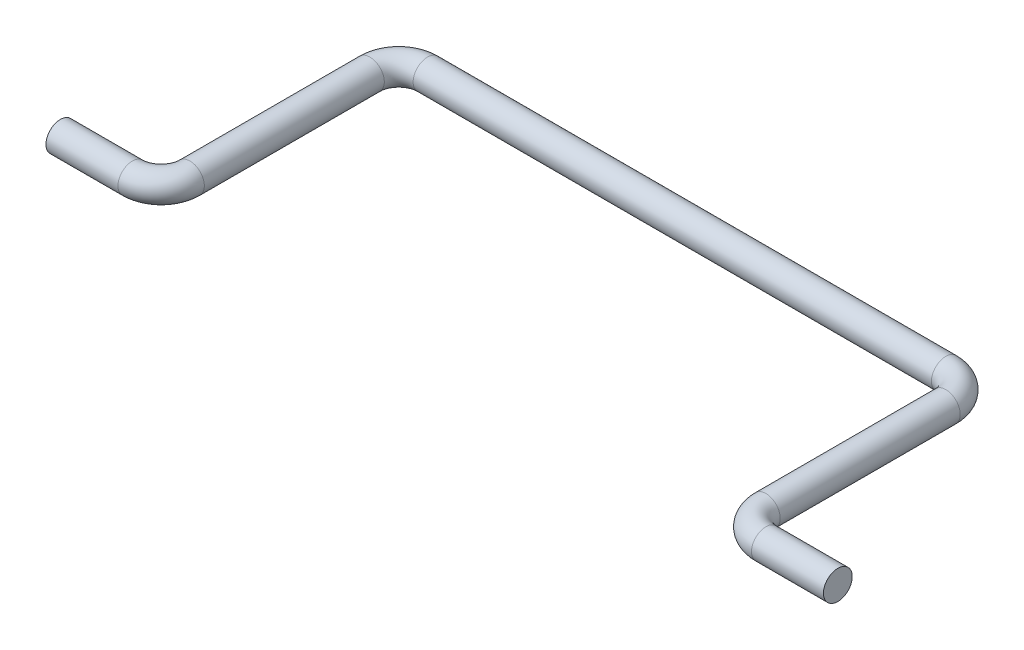
ISO-10303-21;
HEADER;
FILE_DESCRIPTION(('STEP AP214'),'2;1');
FILE_NAME('part.step','',(''),(''),'','','');
FILE_SCHEMA(('AUTOMOTIVE_DESIGN { 1 0 10303 214 1 1 1 1 }'));
ENDSEC;
DATA;
#1=APPLICATION_CONTEXT('core data for automotive mechanical design processes');
#2=APPLICATION_PROTOCOL_DEFINITION('international standard','automotive_design',2000,#1);
#3=PRODUCT_CONTEXT('',#1,'mechanical');
#4=PRODUCT('Part','Part','',(#3));
#5=PRODUCT_RELATED_PRODUCT_CATEGORY('part','',(#4));
#6=PRODUCT_DEFINITION_FORMATION('','',#4);
#7=PRODUCT_DEFINITION_CONTEXT('part definition',#1,'design');
#8=PRODUCT_DEFINITION('design','',#6,#7);
#9=PRODUCT_DEFINITION_SHAPE('','',#8);
#10=(LENGTH_UNIT() NAMED_UNIT(*) SI_UNIT(.MILLI.,.METRE.));
#11=(NAMED_UNIT(*) PLANE_ANGLE_UNIT() SI_UNIT($,.RADIAN.));
#12=(NAMED_UNIT(*) SI_UNIT($,.STERADIAN.) SOLID_ANGLE_UNIT());
#13=UNCERTAINTY_MEASURE_WITH_UNIT(LENGTH_MEASURE(1.E-05),#10,'distance_accuracy_value','');
#14=(GEOMETRIC_REPRESENTATION_CONTEXT(3) GLOBAL_UNCERTAINTY_ASSIGNED_CONTEXT((#13)) GLOBAL_UNIT_ASSIGNED_CONTEXT((#10,
#11,#12)) REPRESENTATION_CONTEXT('',''));
#15=CARTESIAN_POINT('',(0.,0.,0.));
#16=DIRECTION('',(0.,0.,1.));
#17=DIRECTION('',(1.,0.,0.));
#18=AXIS2_PLACEMENT_3D('',#15,#16,#17);
#19=CARTESIAN_POINT('',(-13.4999999999964,0.,0.));
#20=DIRECTION('',(1.,0.,0.));
#21=DIRECTION('',(0.,0.,-1.));
#22=AXIS2_PLACEMENT_3D('',#19,#20,#21);
#23=PLANE('',#22);
#24=CARTESIAN_POINT('',(-13.4999999999964,0.,0.));
#25=DIRECTION('',(1.,0.,0.));
#26=DIRECTION('',(0.,0.,-1.));
#27=AXIS2_PLACEMENT_3D('',#24,#25,#26);
#28=CIRCLE('',#27,0.5);
#29=CARTESIAN_POINT('',(-13.4999999999964,0.,-0.5));
#30=VERTEX_POINT('',#29);
#31=EDGE_CURVE('E44',#30,#30,#28,.T.);
#32=ORIENTED_EDGE('',*,*,#31,.F.);
#33=EDGE_LOOP('',(#32));
#34=FACE_BOUND('',#33,.T.);
#35=ADVANCED_FACE('F32',(#34),#23,.F.);
#36=CARTESIAN_POINT('',(13.4999999999964,0.,0.));
#37=DIRECTION('',(1.,0.,0.));
#38=DIRECTION('',(0.,0.,-1.));
#39=AXIS2_PLACEMENT_3D('',#36,#37,#38);
#40=PLANE('',#39);
#41=CARTESIAN_POINT('',(13.4999999999964,0.,0.));
#42=DIRECTION('',(1.,0.,0.));
#43=DIRECTION('',(0.,0.,-1.));
#44=AXIS2_PLACEMENT_3D('',#41,#42,#43);
#45=CIRCLE('',#44,0.5);
#46=CARTESIAN_POINT('',(13.4999999999964,0.,-0.5));
#47=VERTEX_POINT('',#46);
#48=EDGE_CURVE('E11',#47,#47,#45,.T.);
#49=ORIENTED_EDGE('',*,*,#48,.T.);
#50=EDGE_LOOP('',(#49));
#51=FACE_BOUND('',#50,.T.);
#52=ADVANCED_FACE('F47',(#51),#40,.T.);
#53=CARTESIAN_POINT('',(-13.4999999999964,0.,0.));
#54=DIRECTION('',(1.,0.,0.));
#55=DIRECTION('',(0.,0.,-1.));
#56=AXIS2_PLACEMENT_3D('',#53,#54,#55);
#57=CYLINDRICAL_SURFACE('',#56,0.5);
#58=CARTESIAN_POINT('',(-10.9999999999952,0.,0.));
#59=DIRECTION('',(1.,0.,0.));
#60=DIRECTION('',(0.,0.,-1.));
#61=AXIS2_PLACEMENT_3D('',#58,#59,#60);
#62=CIRCLE('',#61,0.5);
#63=CARTESIAN_POINT('',(-10.9999999999952,0.,0.500000000000094));
#64=VERTEX_POINT('',#63);
#65=EDGE_CURVE('E76',#64,#64,#62,.T.);
#66=ORIENTED_EDGE('',*,*,#65,.F.);
#67=EDGE_LOOP('',(#66));
#68=FACE_BOUND('',#67,.T.);
#69=ORIENTED_EDGE('',*,*,#31,.T.);
#70=EDGE_LOOP('',(#69));
#71=FACE_BOUND('',#70,.T.);
#72=ADVANCED_FACE('F80',(#68,#71),#57,.T.);
#73=CARTESIAN_POINT('',(-10.9999999999952,0.,-1.));
#74=DIRECTION('',(0.,1.,0.));
#75=DIRECTION('',(0.,0.,1.));
#76=AXIS2_PLACEMENT_3D('',#73,#74,#75);
#77=TOROIDAL_SURFACE('',#76,1.00000000000009,0.5);
#78=CARTESIAN_POINT('',(-9.99999999999519,0.,-1.00000000000001));
#79=DIRECTION('',(0.,0.,-1.));
#80=DIRECTION('',(-1.,0.,0.));
#81=AXIS2_PLACEMENT_3D('',#78,#79,#80);
#82=CIRCLE('',#81,0.5);
#83=CARTESIAN_POINT('',(-9.4999999999951,0.,-1.00000000000001));
#84=VERTEX_POINT('',#83);
#85=EDGE_CURVE('E73',#84,#84,#82,.T.);
#86=CARTESIAN_POINT('',(-10.9999999999952,0.,-1.));
#87=DIRECTION('',(0.,1.,0.));
#88=DIRECTION('',(0.,0.,1.));
#89=AXIS2_PLACEMENT_3D('',#86,#87,#88);
#90=CIRCLE('',#89,1.50000000000009);
#91=EDGE_CURVE('',#64,#84,#90,.T.);
#92=ORIENTED_EDGE('',*,*,#65,.T.);
#93=ORIENTED_EDGE('',*,*,#85,.F.);
#94=ORIENTED_EDGE('',*,*,#91,.T.);
#95=ORIENTED_EDGE('',*,*,#91,.F.);
#96=EDGE_LOOP('',(#92,#94,#93,#95));
#97=FACE_BOUND('',#96,.T.);
#98=ADVANCED_FACE('F82',(#97),#77,.T.);
#99=CARTESIAN_POINT('',(-9.99999999999519,0.,-1.00000000000001));
#100=DIRECTION('',(0.,0.,-1.));
#101=DIRECTION('',(-1.,0.,0.));
#102=AXIS2_PLACEMENT_3D('',#99,#100,#101);
#103=CYLINDRICAL_SURFACE('',#102,0.5);
#104=CARTESIAN_POINT('',(-9.99999999999519,0.,-7.25000000000193));
#105=DIRECTION('',(0.,0.,-1.));
#106=DIRECTION('',(-1.,0.,0.));
#107=AXIS2_PLACEMENT_3D('',#104,#105,#106);
#108=CIRCLE('',#107,0.5);
#109=CARTESIAN_POINT('',(-10.4999999999952,0.,-7.25000000000192));
#110=VERTEX_POINT('',#109);
#111=EDGE_CURVE('E70',#110,#110,#108,.T.);
#112=ORIENTED_EDGE('',*,*,#111,.F.);
#113=EDGE_LOOP('',(#112));
#114=FACE_BOUND('',#113,.T.);
#115=ORIENTED_EDGE('',*,*,#85,.T.);
#116=EDGE_LOOP('',(#115));
#117=FACE_BOUND('',#116,.T.);
#118=ADVANCED_FACE('F89',(#114,#117),#103,.T.);
#119=CARTESIAN_POINT('',(-8.99999999999519,0.,-7.25000000000193));
#120=DIRECTION('',(0.,-1.,0.));
#121=DIRECTION('',(0.,0.,-1.));
#122=AXIS2_PLACEMENT_3D('',#119,#120,#121);
#123=TOROIDAL_SURFACE('',#122,1.,0.5);
#124=CARTESIAN_POINT('',(-8.99999999999519,0.,-8.25000000000193));
#125=DIRECTION('',(1.,0.,0.));
#126=DIRECTION('',(0.,0.,-1.));
#127=AXIS2_PLACEMENT_3D('',#124,#125,#126);
#128=CIRCLE('',#127,0.5);
#129=CARTESIAN_POINT('',(-8.99999999999519,0.,-8.75000000000193));
#130=VERTEX_POINT('',#129);
#131=EDGE_CURVE('E67',#130,#130,#128,.T.);
#132=CARTESIAN_POINT('',(-8.99999999999519,0.,-7.25000000000193));
#133=DIRECTION('',(0.,-1.,0.));
#134=DIRECTION('',(0.,0.,-1.));
#135=AXIS2_PLACEMENT_3D('',#132,#133,#134);
#136=CIRCLE('',#135,1.5);
#137=EDGE_CURVE('',#110,#130,#136,.T.);
#138=ORIENTED_EDGE('',*,*,#111,.T.);
#139=ORIENTED_EDGE('',*,*,#131,.F.);
#140=ORIENTED_EDGE('',*,*,#137,.T.);
#141=ORIENTED_EDGE('',*,*,#137,.F.);
#142=EDGE_LOOP('',(#138,#140,#139,#141));
#143=FACE_BOUND('',#142,.T.);
#144=ADVANCED_FACE('F96',(#143),#123,.T.);
#145=CARTESIAN_POINT('',(-8.99999999999519,0.,-8.25000000000193));
#146=DIRECTION('',(1.,0.,0.));
#147=DIRECTION('',(0.,0.,-1.));
#148=AXIS2_PLACEMENT_3D('',#145,#146,#147);
#149=CYLINDRICAL_SURFACE('',#148,0.5);
#150=CARTESIAN_POINT('',(9.00000000000937,0.,-8.25000000000193));
#151=DIRECTION('',(1.,0.,0.));
#152=DIRECTION('',(0.,0.,-1.));
#153=AXIS2_PLACEMENT_3D('',#150,#151,#152);
#154=CIRCLE('',#153,0.5);
#155=CARTESIAN_POINT('',(9.00000000000936,0.,-8.75000000000203));
#156=VERTEX_POINT('',#155);
#157=EDGE_CURVE('E64',#156,#156,#154,.T.);
#158=ORIENTED_EDGE('',*,*,#157,.F.);
#159=EDGE_LOOP('',(#158));
#160=FACE_BOUND('',#159,.T.);
#161=ORIENTED_EDGE('',*,*,#131,.T.);
#162=EDGE_LOOP('',(#161));
#163=FACE_BOUND('',#162,.T.);
#164=ADVANCED_FACE('F100',(#160,#163),#149,.T.);
#165=CARTESIAN_POINT('',(9.00000000000938,0.,-7.25000000000193));
#166=DIRECTION('',(0.,-1.,0.));
#167=DIRECTION('',(0.,0.,-1.));
#168=AXIS2_PLACEMENT_3D('',#165,#166,#167);
#169=TOROIDAL_SURFACE('',#168,1.00000000000009,0.5);
#170=CARTESIAN_POINT('',(10.0000000000094,0.,-7.25000000000193));
#171=DIRECTION('',(0.,0.,1.));
#172=DIRECTION('',(1.,0.,0.));
#173=AXIS2_PLACEMENT_3D('',#170,#171,#172);
#174=CIRCLE('',#173,0.5);
#175=CARTESIAN_POINT('',(10.5000000000095,0.,-7.25000000000193));
#176=VERTEX_POINT('',#175);
#177=EDGE_CURVE('E59',#176,#176,#174,.T.);
#178=CARTESIAN_POINT('',(9.00000000000938,0.,-7.25000000000193));
#179=DIRECTION('',(0.,-1.,0.));
#180=DIRECTION('',(0.,0.,-1.));
#181=AXIS2_PLACEMENT_3D('',#178,#179,#180);
#182=CIRCLE('',#181,1.50000000000009);
#183=EDGE_CURVE('',#156,#176,#182,.T.);
#184=ORIENTED_EDGE('',*,*,#157,.T.);
#185=ORIENTED_EDGE('',*,*,#177,.F.);
#186=ORIENTED_EDGE('',*,*,#183,.T.);
#187=ORIENTED_EDGE('',*,*,#183,.F.);
#188=EDGE_LOOP('',(#184,#186,#185,#187));
#189=FACE_BOUND('',#188,.T.);
#190=ADVANCED_FACE('F104',(#189),#169,.T.);
#191=CARTESIAN_POINT('',(10.0000000000094,0.,-7.25000000000193));
#192=DIRECTION('',(0.,0.,1.));
#193=DIRECTION('',(1.,0.,0.));
#194=AXIS2_PLACEMENT_3D('',#191,#192,#193);
#195=CYLINDRICAL_SURFACE('',#194,0.5);
#196=CARTESIAN_POINT('',(10.0000000000094,0.,-1.00000000000001));
#197=DIRECTION('',(0.,0.,1.));
#198=DIRECTION('',(1.,0.,0.));
#199=AXIS2_PLACEMENT_3D('',#196,#197,#198);
#200=CIRCLE('',#199,0.5);
#201=CARTESIAN_POINT('',(9.5000000000094,0.,-1.00000000000001));
#202=VERTEX_POINT('',#201);
#203=EDGE_CURVE('E57',#202,#202,#200,.T.);
#204=ORIENTED_EDGE('',*,*,#203,.F.);
#205=EDGE_LOOP('',(#204));
#206=FACE_BOUND('',#205,.T.);
#207=ORIENTED_EDGE('',*,*,#177,.T.);
#208=EDGE_LOOP('',(#207));
#209=FACE_BOUND('',#208,.T.);
#210=ADVANCED_FACE('F108',(#206,#209),#195,.T.);
#211=CARTESIAN_POINT('',(11.0000000000094,0.,-1.));
#212=DIRECTION('',(0.,1.,0.));
#213=DIRECTION('',(0.,0.,1.));
#214=AXIS2_PLACEMENT_3D('',#211,#212,#213);
#215=TOROIDAL_SURFACE('',#214,1.,0.5);
#216=CARTESIAN_POINT('',(11.0000000000094,0.,0.));
#217=DIRECTION('',(1.,0.,0.));
#218=DIRECTION('',(0.,0.,-1.));
#219=AXIS2_PLACEMENT_3D('',#216,#217,#218);
#220=CIRCLE('',#219,0.5);
#221=CARTESIAN_POINT('',(11.0000000000094,0.,0.500000000000001));
#222=VERTEX_POINT('',#221);
#223=EDGE_CURVE('E39',#222,#222,#220,.T.);
#224=CARTESIAN_POINT('',(11.0000000000094,0.,-1.));
#225=DIRECTION('',(0.,1.,0.));
#226=DIRECTION('',(0.,0.,1.));
#227=AXIS2_PLACEMENT_3D('',#224,#225,#226);
#228=CIRCLE('',#227,1.5);
#229=EDGE_CURVE('',#202,#222,#228,.T.);
#230=ORIENTED_EDGE('',*,*,#203,.T.);
#231=ORIENTED_EDGE('',*,*,#223,.F.);
#232=ORIENTED_EDGE('',*,*,#229,.T.);
#233=ORIENTED_EDGE('',*,*,#229,.F.);
#234=EDGE_LOOP('',(#230,#232,#231,#233));
#235=FACE_BOUND('',#234,.T.);
#236=ADVANCED_FACE('F52',(#235),#215,.T.);
#237=CARTESIAN_POINT('',(11.0000000000094,0.,0.));
#238=DIRECTION('',(1.,0.,0.));
#239=DIRECTION('',(0.,0.,-1.));
#240=AXIS2_PLACEMENT_3D('',#237,#238,#239);
#241=CYLINDRICAL_SURFACE('',#240,0.5);
#242=ORIENTED_EDGE('',*,*,#48,.F.);
#243=EDGE_LOOP('',(#242));
#244=FACE_BOUND('',#243,.T.);
#245=ORIENTED_EDGE('',*,*,#223,.T.);
#246=EDGE_LOOP('',(#245));
#247=FACE_BOUND('',#246,.T.);
#248=ADVANCED_FACE('F49',(#244,#247),#241,.T.);
#249=CLOSED_SHELL('',(#35,#52,#72,#98,#118,#144,#164,#190,#210,#236,#248));
#250=MANIFOLD_SOLID_BREP('B2',#249);
#251=ADVANCED_BREP_SHAPE_REPRESENTATION('',(#18,#250),#14);
#252=SHAPE_DEFINITION_REPRESENTATION(#9,#251);
ENDSEC;
END-ISO-10303-21;
